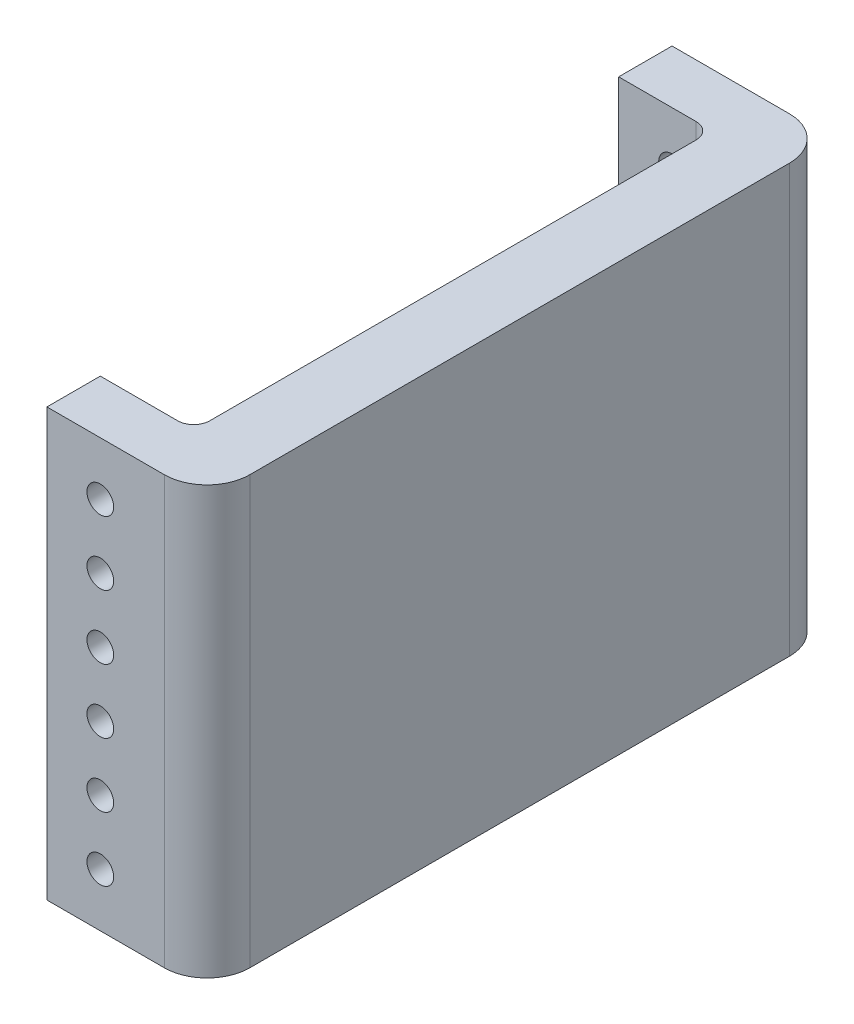
ISO-10303-21;
HEADER;
FILE_DESCRIPTION(('STEP AP214'),'2;1');
FILE_NAME('part.step','',(''),(''),'','','');
FILE_SCHEMA(('AUTOMOTIVE_DESIGN { 1 0 10303 214 1 1 1 1 }'));
ENDSEC;
DATA;
#1=APPLICATION_CONTEXT('core data for automotive mechanical design processes');
#2=APPLICATION_PROTOCOL_DEFINITION('international standard','automotive_design',2000,#1);
#3=PRODUCT_CONTEXT('',#1,'mechanical');
#4=PRODUCT('Part','Part','',(#3));
#5=PRODUCT_RELATED_PRODUCT_CATEGORY('part','',(#4));
#6=PRODUCT_DEFINITION_FORMATION('','',#4);
#7=PRODUCT_DEFINITION_CONTEXT('part definition',#1,'design');
#8=PRODUCT_DEFINITION('design','',#6,#7);
#9=PRODUCT_DEFINITION_SHAPE('','',#8);
#10=(LENGTH_UNIT() NAMED_UNIT(*) SI_UNIT(.MILLI.,.METRE.));
#11=(NAMED_UNIT(*) PLANE_ANGLE_UNIT() SI_UNIT($,.RADIAN.));
#12=(NAMED_UNIT(*) SI_UNIT($,.STERADIAN.) SOLID_ANGLE_UNIT());
#13=UNCERTAINTY_MEASURE_WITH_UNIT(LENGTH_MEASURE(1.E-05),#10,'distance_accuracy_value','');
#14=(GEOMETRIC_REPRESENTATION_CONTEXT(3) GLOBAL_UNCERTAINTY_ASSIGNED_CONTEXT((#13)) GLOBAL_UNIT_ASSIGNED_CONTEXT((#10,
#11,#12)) REPRESENTATION_CONTEXT('',''));
#15=CARTESIAN_POINT('',(0.,0.,0.));
#16=DIRECTION('',(0.,0.,1.));
#17=DIRECTION('',(1.,0.,0.));
#18=AXIS2_PLACEMENT_3D('',#15,#16,#17);
#19=CARTESIAN_POINT('',(0.,0.,0.));
#20=DIRECTION('',(1.,0.,0.));
#21=DIRECTION('',(0.,0.,-1.));
#22=AXIS2_PLACEMENT_3D('',#19,#20,#21);
#23=PLANE('',#22);
#24=DIRECTION('',(0.,0.,-1.));
#25=VECTOR('',#24,1.);
#26=CARTESIAN_POINT('',(0.,561.257561403509,837.51152631579));
#27=LINE('',#26,#25);
#28=CARTESIAN_POINT('',(0.,561.257561403509,565.47752631579));
#29=VERTEX_POINT('',#28);
#30=CARTESIAN_POINT('',(0.,561.257561403509,540.07752631579));
#31=VERTEX_POINT('',#30);
#32=EDGE_CURVE('E130',#29,#31,#27,.T.);
#33=ORIENTED_EDGE('',*,*,#32,.F.);
#34=DIRECTION('',(0.,1.,0.));
#35=VECTOR('',#34,1.);
#36=CARTESIAN_POINT('',(0.,561.257561403509,565.47752631579));
#37=LINE('',#36,#35);
#38=CARTESIAN_POINT('',(0.,764.457561403509,565.47752631579));
#39=VERTEX_POINT('',#38);
#40=EDGE_CURVE('E137',#29,#39,#37,.T.);
#41=ORIENTED_EDGE('',*,*,#40,.T.);
#42=DIRECTION('',(0.,0.,1.));
#43=VECTOR('',#42,1.);
#44=CARTESIAN_POINT('',(0.,764.457561403509,837.51152631579));
#45=LINE('',#44,#43);
#46=CARTESIAN_POINT('',(0.,764.457561403509,540.07752631579));
#47=VERTEX_POINT('',#46);
#48=EDGE_CURVE('E157',#47,#39,#45,.T.);
#49=ORIENTED_EDGE('',*,*,#48,.F.);
#50=DIRECTION('',(0.,1.,0.));
#51=VECTOR('',#50,1.);
#52=CARTESIAN_POINT('',(0.,764.457561403509,540.07752631579));
#53=LINE('',#52,#51);
#54=EDGE_CURVE('E147',#31,#47,#53,.T.);
#55=ORIENTED_EDGE('',*,*,#54,.F.);
#56=EDGE_LOOP('',(#33,#41,#49,#55));
#57=FACE_BOUND('',#56,.T.);
#58=ADVANCED_FACE('F39',(#57),#23,.F.);
#59=CARTESIAN_POINT('',(76.2,764.457561403509,837.51152631579));
#60=DIRECTION('',(0.,0.,-1.));
#61=DIRECTION('',(0.,1.,0.));
#62=AXIS2_PLACEMENT_3D('',#59,#60,#61);
#63=PLANE('',#62);
#64=CARTESIAN_POINT('',(25.4,739.057561403509,837.51152631579));
#65=DIRECTION('',(0.,0.,1.));
#66=DIRECTION('',(1.,0.,0.));
#67=AXIS2_PLACEMENT_3D('',#64,#65,#66);
#68=CIRCLE('',#67,6.35);
#69=CARTESIAN_POINT('',(31.75,739.057561403509,837.51152631579));
#70=VERTEX_POINT('',#69);
#71=EDGE_CURVE('E573',#70,#70,#68,.T.);
#72=ORIENTED_EDGE('',*,*,#71,.F.);
#73=EDGE_LOOP('',(#72));
#74=FACE_BOUND('',#73,.T.);
#75=CARTESIAN_POINT('',(25.4,708.577561403509,837.51152631579));
#76=DIRECTION('',(0.,0.,1.));
#77=DIRECTION('',(1.,0.,0.));
#78=AXIS2_PLACEMENT_3D('',#75,#76,#77);
#79=CIRCLE('',#78,6.35);
#80=CARTESIAN_POINT('',(31.75,708.577561403509,837.51152631579));
#81=VERTEX_POINT('',#80);
#82=EDGE_CURVE('E570',#81,#81,#79,.T.);
#83=ORIENTED_EDGE('',*,*,#82,.F.);
#84=EDGE_LOOP('',(#83));
#85=FACE_BOUND('',#84,.T.);
#86=CARTESIAN_POINT('',(25.4,678.097561403509,837.51152631579));
#87=DIRECTION('',(0.,0.,1.));
#88=DIRECTION('',(1.,0.,0.));
#89=AXIS2_PLACEMENT_3D('',#86,#87,#88);
#90=CIRCLE('',#89,6.35);
#91=CARTESIAN_POINT('',(31.75,678.097561403509,837.51152631579));
#92=VERTEX_POINT('',#91);
#93=EDGE_CURVE('E564',#92,#92,#90,.T.);
#94=ORIENTED_EDGE('',*,*,#93,.F.);
#95=EDGE_LOOP('',(#94));
#96=FACE_BOUND('',#95,.T.);
#97=CARTESIAN_POINT('',(25.4,647.617561403509,837.51152631579));
#98=DIRECTION('',(0.,0.,1.));
#99=DIRECTION('',(1.,0.,0.));
#100=AXIS2_PLACEMENT_3D('',#97,#98,#99);
#101=CIRCLE('',#100,6.35);
#102=CARTESIAN_POINT('',(31.75,647.617561403509,837.51152631579));
#103=VERTEX_POINT('',#102);
#104=EDGE_CURVE('E558',#103,#103,#101,.T.);
#105=ORIENTED_EDGE('',*,*,#104,.F.);
#106=EDGE_LOOP('',(#105));
#107=FACE_BOUND('',#106,.T.);
#108=CARTESIAN_POINT('',(25.4,617.137561403509,837.51152631579));
#109=DIRECTION('',(0.,0.,1.));
#110=DIRECTION('',(1.,0.,0.));
#111=AXIS2_PLACEMENT_3D('',#108,#109,#110);
#112=CIRCLE('',#111,6.35);
#113=CARTESIAN_POINT('',(31.75,617.137561403509,837.51152631579));
#114=VERTEX_POINT('',#113);
#115=EDGE_CURVE('E520',#114,#114,#112,.T.);
#116=ORIENTED_EDGE('',*,*,#115,.F.);
#117=EDGE_LOOP('',(#116));
#118=FACE_BOUND('',#117,.T.);
#119=CARTESIAN_POINT('',(25.4,586.657561403509,837.51152631579));
#120=DIRECTION('',(0.,0.,1.));
#121=DIRECTION('',(1.,0.,0.));
#122=AXIS2_PLACEMENT_3D('',#119,#120,#121);
#123=CIRCLE('',#122,6.35);
#124=CARTESIAN_POINT('',(31.75,586.657561403509,837.51152631579));
#125=VERTEX_POINT('',#124);
#126=EDGE_CURVE('E512',#125,#125,#123,.T.);
#127=ORIENTED_EDGE('',*,*,#126,.F.);
#128=EDGE_LOOP('',(#127));
#129=FACE_BOUND('',#128,.T.);
#130=DIRECTION('',(-1.,0.,0.));
#131=VECTOR('',#130,1.);
#132=CARTESIAN_POINT('',(76.2,561.257561403509,837.51152631579));
#133=LINE('',#132,#131);
#134=CARTESIAN_POINT('',(55.88,561.257561403509,837.51152631579));
#135=VERTEX_POINT('',#134);
#136=CARTESIAN_POINT('',(0.,561.257561403509,837.51152631579));
#137=VERTEX_POINT('',#136);
#138=EDGE_CURVE('E167',#135,#137,#133,.T.);
#139=ORIENTED_EDGE('',*,*,#138,.F.);
#140=DIRECTION('',(0.,-1.,0.));
#141=VECTOR('',#140,1.);
#142=CARTESIAN_POINT('',(55.88,764.457561403509,837.51152631579));
#143=LINE('',#142,#141);
#144=CARTESIAN_POINT('',(55.88,764.457561403509,837.51152631579));
#145=VERTEX_POINT('',#144);
#146=EDGE_CURVE('E210',#135,#145,#143,.F.);
#147=ORIENTED_EDGE('',*,*,#146,.T.);
#148=DIRECTION('',(-1.,0.,0.));
#149=VECTOR('',#148,1.);
#150=CARTESIAN_POINT('',(76.2,764.457561403509,837.51152631579));
#151=LINE('',#150,#149);
#152=CARTESIAN_POINT('',(0.,764.457561403509,837.51152631579));
#153=VERTEX_POINT('',#152);
#154=EDGE_CURVE('E160',#145,#153,#151,.T.);
#155=ORIENTED_EDGE('',*,*,#154,.T.);
#156=DIRECTION('',(0.,-1.,0.));
#157=VECTOR('',#156,1.);
#158=CARTESIAN_POINT('',(0.,764.457561403509,837.51152631579));
#159=LINE('',#158,#157);
#160=EDGE_CURVE('E144',#153,#137,#159,.T.);
#161=ORIENTED_EDGE('',*,*,#160,.T.);
#162=EDGE_LOOP('',(#139,#147,#155,#161));
#163=FACE_BOUND('',#162,.T.);
#164=ADVANCED_FACE('F244',(#74,#85,#96,#107,#118,#129,#163),#63,.F.);
#165=CARTESIAN_POINT('',(76.2,561.257561403509,837.51152631579));
#166=DIRECTION('',(0.,1.,0.));
#167=DIRECTION('',(0.,0.,1.));
#168=AXIS2_PLACEMENT_3D('',#165,#166,#167);
#169=PLANE('',#168);
#170=DIRECTION('',(-1.,0.,0.));
#171=VECTOR('',#170,1.);
#172=CARTESIAN_POINT('',(76.2,561.257561403509,540.07752631579));
#173=LINE('',#172,#171);
#174=CARTESIAN_POINT('',(55.88,561.257561403509,540.07752631579));
#175=VERTEX_POINT('',#174);
#176=EDGE_CURVE('E165',#175,#31,#173,.T.);
#177=ORIENTED_EDGE('',*,*,#176,.F.);
#178=CARTESIAN_POINT('',(55.88,561.257561403509,560.39752631579));
#179=DIRECTION('',(0.,1.,0.));
#180=DIRECTION('',(0.,0.,1.));
#181=AXIS2_PLACEMENT_3D('',#178,#179,#180);
#182=CIRCLE('',#181,20.32);
#183=CARTESIAN_POINT('',(76.2,561.257561403509,560.39752631579));
#184=VERTEX_POINT('',#183);
#185=EDGE_CURVE('E208',#175,#184,#182,.F.);
#186=ORIENTED_EDGE('',*,*,#185,.T.);
#187=DIRECTION('',(0.,0.,-1.));
#188=VECTOR('',#187,1.);
#189=CARTESIAN_POINT('',(76.2,561.257561403509,837.51152631579));
#190=LINE('',#189,#188);
#191=CARTESIAN_POINT('',(76.2,561.257561403509,817.19152631579));
#192=VERTEX_POINT('',#191);
#193=EDGE_CURVE('E159',#192,#184,#190,.T.);
#194=ORIENTED_EDGE('',*,*,#193,.F.);
#195=CARTESIAN_POINT('',(55.88,561.257561403509,817.19152631579));
#196=DIRECTION('',(0.,1.,0.));
#197=DIRECTION('',(0.,0.,1.));
#198=AXIS2_PLACEMENT_3D('',#195,#196,#197);
#199=CIRCLE('',#198,20.32);
#200=EDGE_CURVE('E206',#192,#135,#199,.F.);
#201=ORIENTED_EDGE('',*,*,#200,.T.);
#202=ORIENTED_EDGE('',*,*,#138,.T.);
#203=CARTESIAN_POINT('',(0.,561.257561403509,812.11152631579));
#204=VERTEX_POINT('',#203);
#205=EDGE_CURVE('E148',#137,#204,#27,.T.);
#206=ORIENTED_EDGE('',*,*,#205,.T.);
#207=DIRECTION('',(1.,0.,0.));
#208=VECTOR('',#207,1.);
#209=CARTESIAN_POINT('',(0.,561.257561403509,812.11152631579));
#210=LINE('',#209,#208);
#211=CARTESIAN_POINT('',(36.83,561.257561403509,812.11152631579));
#212=VERTEX_POINT('',#211);
#213=EDGE_CURVE('E281',#204,#212,#210,.T.);
#214=ORIENTED_EDGE('',*,*,#213,.T.);
#215=CARTESIAN_POINT('',(36.83,561.257561403509,804.49152631579));
#216=DIRECTION('',(0.,1.,0.));
#217=DIRECTION('',(0.,0.,1.));
#218=AXIS2_PLACEMENT_3D('',#215,#216,#217);
#219=CIRCLE('',#218,7.62);
#220=CARTESIAN_POINT('',(44.45,561.257561403509,804.49152631579));
#221=VERTEX_POINT('',#220);
#222=EDGE_CURVE('E223',#212,#221,#219,.T.);
#223=ORIENTED_EDGE('',*,*,#222,.T.);
#224=DIRECTION('',(0.,0.,-1.));
#225=VECTOR('',#224,1.);
#226=CARTESIAN_POINT('',(44.45,561.257561403509,565.47752631579));
#227=LINE('',#226,#225);
#228=CARTESIAN_POINT('',(44.45,561.257561403509,573.09752631579));
#229=VERTEX_POINT('',#228);
#230=EDGE_CURVE('E134',#221,#229,#227,.T.);
#231=ORIENTED_EDGE('',*,*,#230,.T.);
#232=CARTESIAN_POINT('',(36.83,561.257561403509,573.09752631579));
#233=DIRECTION('',(0.,1.,0.));
#234=DIRECTION('',(0.,0.,1.));
#235=AXIS2_PLACEMENT_3D('',#232,#233,#234);
#236=CIRCLE('',#235,7.62);
#237=CARTESIAN_POINT('',(36.83,561.257561403509,565.47752631579));
#238=VERTEX_POINT('',#237);
#239=EDGE_CURVE('E11',#229,#238,#236,.T.);
#240=ORIENTED_EDGE('',*,*,#239,.T.);
#241=DIRECTION('',(-1.,0.,0.));
#242=VECTOR('',#241,1.);
#243=CARTESIAN_POINT('',(0.,561.257561403509,565.47752631579));
#244=LINE('',#243,#242);
#245=EDGE_CURVE('E125',#238,#29,#244,.T.);
#246=ORIENTED_EDGE('',*,*,#245,.T.);
#247=ORIENTED_EDGE('',*,*,#32,.T.);
#248=EDGE_LOOP('',(#177,#186,#194,#201,#202,#206,#214,#223,#231,#240,#246,#247));
#249=FACE_BOUND('',#248,.T.);
#250=ADVANCED_FACE('F128',(#249),#169,.F.);
#251=CARTESIAN_POINT('',(76.2,764.457561403509,540.07752631579));
#252=DIRECTION('',(0.,0.,1.));
#253=DIRECTION('',(1.,0.,0.));
#254=AXIS2_PLACEMENT_3D('',#251,#252,#253);
#255=PLANE('',#254);
#256=CARTESIAN_POINT('',(25.4,739.057561403509,540.07752631579));
#257=DIRECTION('',(0.,0.,1.));
#258=DIRECTION('',(1.,0.,0.));
#259=AXIS2_PLACEMENT_3D('',#256,#257,#258);
#260=CIRCLE('',#259,6.35);
#261=CARTESIAN_POINT('',(31.75,739.057561403509,540.07752631579));
#262=VERTEX_POINT('',#261);
#263=EDGE_CURVE('E174',#262,#262,#260,.T.);
#264=ORIENTED_EDGE('',*,*,#263,.T.);
#265=EDGE_LOOP('',(#264));
#266=FACE_BOUND('',#265,.T.);
#267=CARTESIAN_POINT('',(25.4,708.577561403509,540.07752631579));
#268=DIRECTION('',(0.,0.,1.));
#269=DIRECTION('',(1.,0.,0.));
#270=AXIS2_PLACEMENT_3D('',#267,#268,#269);
#271=CIRCLE('',#270,6.35);
#272=CARTESIAN_POINT('',(31.75,708.577561403509,540.07752631579));
#273=VERTEX_POINT('',#272);
#274=EDGE_CURVE('E567',#273,#273,#271,.T.);
#275=ORIENTED_EDGE('',*,*,#274,.T.);
#276=EDGE_LOOP('',(#275));
#277=FACE_BOUND('',#276,.T.);
#278=CARTESIAN_POINT('',(25.4,678.097561403509,540.07752631579));
#279=DIRECTION('',(0.,0.,1.));
#280=DIRECTION('',(1.,0.,0.));
#281=AXIS2_PLACEMENT_3D('',#278,#279,#280);
#282=CIRCLE('',#281,6.35);
#283=CARTESIAN_POINT('',(31.75,678.097561403509,540.07752631579));
#284=VERTEX_POINT('',#283);
#285=EDGE_CURVE('E561',#284,#284,#282,.T.);
#286=ORIENTED_EDGE('',*,*,#285,.T.);
#287=EDGE_LOOP('',(#286));
#288=FACE_BOUND('',#287,.T.);
#289=CARTESIAN_POINT('',(25.4,647.617561403509,540.07752631579));
#290=DIRECTION('',(0.,0.,1.));
#291=DIRECTION('',(1.,0.,0.));
#292=AXIS2_PLACEMENT_3D('',#289,#290,#291);
#293=CIRCLE('',#292,6.35);
#294=CARTESIAN_POINT('',(31.75,647.617561403509,540.07752631579));
#295=VERTEX_POINT('',#294);
#296=EDGE_CURVE('E555',#295,#295,#293,.T.);
#297=ORIENTED_EDGE('',*,*,#296,.T.);
#298=EDGE_LOOP('',(#297));
#299=FACE_BOUND('',#298,.T.);
#300=CARTESIAN_POINT('',(25.4,617.137561403509,540.07752631579));
#301=DIRECTION('',(0.,0.,1.));
#302=DIRECTION('',(1.,0.,0.));
#303=AXIS2_PLACEMENT_3D('',#300,#301,#302);
#304=CIRCLE('',#303,6.35);
#305=CARTESIAN_POINT('',(31.75,617.137561403509,540.07752631579));
#306=VERTEX_POINT('',#305);
#307=EDGE_CURVE('E516',#306,#306,#304,.T.);
#308=ORIENTED_EDGE('',*,*,#307,.T.);
#309=EDGE_LOOP('',(#308));
#310=FACE_BOUND('',#309,.T.);
#311=CARTESIAN_POINT('',(25.4,586.657561403509,540.07752631579));
#312=DIRECTION('',(0.,0.,1.));
#313=DIRECTION('',(1.,0.,0.));
#314=AXIS2_PLACEMENT_3D('',#311,#312,#313);
#315=CIRCLE('',#314,6.35);
#316=CARTESIAN_POINT('',(31.75,586.657561403509,540.07752631579));
#317=VERTEX_POINT('',#316);
#318=EDGE_CURVE('E517',#317,#317,#315,.T.);
#319=ORIENTED_EDGE('',*,*,#318,.T.);
#320=EDGE_LOOP('',(#319));
#321=FACE_BOUND('',#320,.T.);
#322=DIRECTION('',(-1.,0.,0.));
#323=VECTOR('',#322,1.);
#324=CARTESIAN_POINT('',(76.2,764.457561403509,540.07752631579));
#325=LINE('',#324,#323);
#326=CARTESIAN_POINT('',(55.88,764.457561403509,540.07752631579));
#327=VERTEX_POINT('',#326);
#328=EDGE_CURVE('E162',#327,#47,#325,.T.);
#329=ORIENTED_EDGE('',*,*,#328,.F.);
#330=DIRECTION('',(0.,1.,0.));
#331=VECTOR('',#330,1.);
#332=CARTESIAN_POINT('',(55.88,561.257561403509,540.07752631579));
#333=LINE('',#332,#331);
#334=EDGE_CURVE('E204',#327,#175,#333,.F.);
#335=ORIENTED_EDGE('',*,*,#334,.T.);
#336=ORIENTED_EDGE('',*,*,#176,.T.);
#337=ORIENTED_EDGE('',*,*,#54,.T.);
#338=EDGE_LOOP('',(#329,#335,#336,#337));
#339=FACE_BOUND('',#338,.T.);
#340=ADVANCED_FACE('F299',(#266,#277,#288,#299,#310,#321,#339),#255,.F.);
#341=CARTESIAN_POINT('',(76.2,764.457561403509,837.51152631579));
#342=DIRECTION('',(0.,-1.,0.));
#343=DIRECTION('',(0.,0.,-1.));
#344=AXIS2_PLACEMENT_3D('',#341,#342,#343);
#345=PLANE('',#344);
#346=DIRECTION('',(0.,0.,1.));
#347=VECTOR('',#346,1.);
#348=CARTESIAN_POINT('',(76.2,764.457561403509,837.51152631579));
#349=LINE('',#348,#347);
#350=CARTESIAN_POINT('',(76.2,764.457561403509,560.39752631579));
#351=VERTEX_POINT('',#350);
#352=CARTESIAN_POINT('',(76.2,764.457561403509,817.19152631579));
#353=VERTEX_POINT('',#352);
#354=EDGE_CURVE('E163',#351,#353,#349,.T.);
#355=ORIENTED_EDGE('',*,*,#354,.F.);
#356=CARTESIAN_POINT('',(55.88,764.457561403509,560.39752631579));
#357=DIRECTION('',(0.,-1.,0.));
#358=DIRECTION('',(0.,0.,-1.));
#359=AXIS2_PLACEMENT_3D('',#356,#357,#358);
#360=CIRCLE('',#359,20.32);
#361=EDGE_CURVE('E202',#351,#327,#360,.F.);
#362=ORIENTED_EDGE('',*,*,#361,.T.);
#363=ORIENTED_EDGE('',*,*,#328,.T.);
#364=ORIENTED_EDGE('',*,*,#48,.T.);
#365=DIRECTION('',(-1.,0.,0.));
#366=VECTOR('',#365,1.);
#367=CARTESIAN_POINT('',(0.,764.457561403509,565.47752631579));
#368=LINE('',#367,#366);
#369=CARTESIAN_POINT('',(36.83,764.457561403509,565.47752631579));
#370=VERTEX_POINT('',#369);
#371=EDGE_CURVE('E140',#370,#39,#368,.T.);
#372=ORIENTED_EDGE('',*,*,#371,.F.);
#373=CARTESIAN_POINT('',(36.83,764.457561403509,573.09752631579));
#374=DIRECTION('',(0.,-1.,0.));
#375=DIRECTION('',(0.,0.,-1.));
#376=AXIS2_PLACEMENT_3D('',#373,#374,#375);
#377=CIRCLE('',#376,7.62);
#378=CARTESIAN_POINT('',(44.45,764.457561403509,573.09752631579));
#379=VERTEX_POINT('',#378);
#380=EDGE_CURVE('E47',#370,#379,#377,.T.);
#381=ORIENTED_EDGE('',*,*,#380,.T.);
#382=DIRECTION('',(0.,0.,-1.));
#383=VECTOR('',#382,1.);
#384=CARTESIAN_POINT('',(44.45,764.457561403509,565.47752631579));
#385=LINE('',#384,#383);
#386=CARTESIAN_POINT('',(44.45,764.457561403509,804.49152631579));
#387=VERTEX_POINT('',#386);
#388=EDGE_CURVE('E229',#387,#379,#385,.T.);
#389=ORIENTED_EDGE('',*,*,#388,.F.);
#390=CARTESIAN_POINT('',(36.83,764.457561403509,804.49152631579));
#391=DIRECTION('',(0.,-1.,0.));
#392=DIRECTION('',(0.,0.,-1.));
#393=AXIS2_PLACEMENT_3D('',#390,#391,#392);
#394=CIRCLE('',#393,7.62);
#395=CARTESIAN_POINT('',(36.83,764.457561403509,812.11152631579));
#396=VERTEX_POINT('',#395);
#397=EDGE_CURVE('E221',#387,#396,#394,.T.);
#398=ORIENTED_EDGE('',*,*,#397,.T.);
#399=DIRECTION('',(1.,0.,0.));
#400=VECTOR('',#399,1.);
#401=CARTESIAN_POINT('',(0.,764.457561403509,812.11152631579));
#402=LINE('',#401,#400);
#403=CARTESIAN_POINT('',(0.,764.457561403509,812.11152631579));
#404=VERTEX_POINT('',#403);
#405=EDGE_CURVE('E234',#404,#396,#402,.T.);
#406=ORIENTED_EDGE('',*,*,#405,.F.);
#407=EDGE_CURVE('E156',#404,#153,#45,.T.);
#408=ORIENTED_EDGE('',*,*,#407,.T.);
#409=ORIENTED_EDGE('',*,*,#154,.F.);
#410=CARTESIAN_POINT('',(55.88,764.457561403509,817.19152631579));
#411=DIRECTION('',(0.,-1.,0.));
#412=DIRECTION('',(0.,0.,-1.));
#413=AXIS2_PLACEMENT_3D('',#410,#411,#412);
#414=CIRCLE('',#413,20.32);
#415=EDGE_CURVE('E200',#145,#353,#414,.F.);
#416=ORIENTED_EDGE('',*,*,#415,.T.);
#417=EDGE_LOOP('',(#355,#362,#363,#364,#372,#381,#389,#398,#406,#408,#409,#416));
#418=FACE_BOUND('',#417,.T.);
#419=ADVANCED_FACE('F228',(#418),#345,.F.);
#420=CARTESIAN_POINT('',(76.2,0.,0.));
#421=DIRECTION('',(1.,0.,0.));
#422=DIRECTION('',(0.,0.,-1.));
#423=AXIS2_PLACEMENT_3D('',#420,#421,#422);
#424=PLANE('',#423);
#425=ORIENTED_EDGE('',*,*,#193,.T.);
#426=DIRECTION('',(0.,1.,0.));
#427=VECTOR('',#426,1.);
#428=CARTESIAN_POINT('',(76.2,764.457561403509,560.39752631579));
#429=LINE('',#428,#427);
#430=EDGE_CURVE('E197',#184,#351,#429,.T.);
#431=ORIENTED_EDGE('',*,*,#430,.T.);
#432=ORIENTED_EDGE('',*,*,#354,.T.);
#433=DIRECTION('',(0.,-1.,0.));
#434=VECTOR('',#433,1.);
#435=CARTESIAN_POINT('',(76.2,561.257561403509,817.19152631579));
#436=LINE('',#435,#434);
#437=EDGE_CURVE('E169',#353,#192,#436,.T.);
#438=ORIENTED_EDGE('',*,*,#437,.T.);
#439=EDGE_LOOP('',(#425,#431,#432,#438));
#440=FACE_BOUND('',#439,.T.);
#441=ADVANCED_FACE('F255',(#440),#424,.T.);
#442=ORIENTED_EDGE('',*,*,#407,.F.);
#443=DIRECTION('',(0.,1.,0.));
#444=VECTOR('',#443,1.);
#445=CARTESIAN_POINT('',(0.,561.257561403509,812.11152631579));
#446=LINE('',#445,#444);
#447=EDGE_CURVE('E133',#204,#404,#446,.T.);
#448=ORIENTED_EDGE('',*,*,#447,.F.);
#449=ORIENTED_EDGE('',*,*,#205,.F.);
#450=ORIENTED_EDGE('',*,*,#160,.F.);
#451=EDGE_LOOP('',(#442,#448,#449,#450));
#452=FACE_BOUND('',#451,.T.);
#453=ADVANCED_FACE('F246',(#452),#23,.F.);
#454=CARTESIAN_POINT('',(0.,561.257561403509,565.47752631579));
#455=DIRECTION('',(0.,0.,-1.));
#456=DIRECTION('',(-1.,0.,0.));
#457=AXIS2_PLACEMENT_3D('',#454,#455,#456);
#458=PLANE('',#457);
#459=CARTESIAN_POINT('',(25.4,739.057561403509,565.47752631579));
#460=DIRECTION('',(0.,0.,-1.));
#461=DIRECTION('',(-1.,0.,0.));
#462=AXIS2_PLACEMENT_3D('',#459,#460,#461);
#463=CIRCLE('',#462,6.35);
#464=CARTESIAN_POINT('',(19.05,739.057561403509,565.47752631579));
#465=VERTEX_POINT('',#464);
#466=EDGE_CURVE('E194',#465,#465,#463,.T.);
#467=ORIENTED_EDGE('',*,*,#466,.T.);
#468=EDGE_LOOP('',(#467));
#469=FACE_BOUND('',#468,.T.);
#470=CARTESIAN_POINT('',(25.4,708.577561403509,565.47752631579));
#471=DIRECTION('',(0.,0.,-1.));
#472=DIRECTION('',(-1.,0.,0.));
#473=AXIS2_PLACEMENT_3D('',#470,#471,#472);
#474=CIRCLE('',#473,6.35);
#475=CARTESIAN_POINT('',(19.05,708.577561403509,565.47752631579));
#476=VERTEX_POINT('',#475);
#477=EDGE_CURVE('E190',#476,#476,#474,.T.);
#478=ORIENTED_EDGE('',*,*,#477,.T.);
#479=EDGE_LOOP('',(#478));
#480=FACE_BOUND('',#479,.T.);
#481=CARTESIAN_POINT('',(25.4,678.097561403509,565.47752631579));
#482=DIRECTION('',(0.,0.,-1.));
#483=DIRECTION('',(-1.,0.,0.));
#484=AXIS2_PLACEMENT_3D('',#481,#482,#483);
#485=CIRCLE('',#484,6.35);
#486=CARTESIAN_POINT('',(19.05,678.097561403509,565.47752631579));
#487=VERTEX_POINT('',#486);
#488=EDGE_CURVE('E186',#487,#487,#485,.T.);
#489=ORIENTED_EDGE('',*,*,#488,.T.);
#490=EDGE_LOOP('',(#489));
#491=FACE_BOUND('',#490,.T.);
#492=CARTESIAN_POINT('',(25.4,647.617561403509,565.47752631579));
#493=DIRECTION('',(0.,0.,-1.));
#494=DIRECTION('',(-1.,0.,0.));
#495=AXIS2_PLACEMENT_3D('',#492,#493,#494);
#496=CIRCLE('',#495,6.35);
#497=CARTESIAN_POINT('',(19.05,647.617561403509,565.47752631579));
#498=VERTEX_POINT('',#497);
#499=EDGE_CURVE('E182',#498,#498,#496,.T.);
#500=ORIENTED_EDGE('',*,*,#499,.T.);
#501=EDGE_LOOP('',(#500));
#502=FACE_BOUND('',#501,.T.);
#503=CARTESIAN_POINT('',(25.4,617.137561403509,565.47752631579));
#504=DIRECTION('',(0.,0.,-1.));
#505=DIRECTION('',(-1.,0.,0.));
#506=AXIS2_PLACEMENT_3D('',#503,#504,#505);
#507=CIRCLE('',#506,6.35);
#508=CARTESIAN_POINT('',(19.05,617.137561403509,565.47752631579));
#509=VERTEX_POINT('',#508);
#510=EDGE_CURVE('E178',#509,#509,#507,.T.);
#511=ORIENTED_EDGE('',*,*,#510,.T.);
#512=EDGE_LOOP('',(#511));
#513=FACE_BOUND('',#512,.T.);
#514=CARTESIAN_POINT('',(25.4,586.657561403509,565.47752631579));
#515=DIRECTION('',(0.,0.,-1.));
#516=DIRECTION('',(-1.,0.,0.));
#517=AXIS2_PLACEMENT_3D('',#514,#515,#516);
#518=CIRCLE('',#517,6.35);
#519=CARTESIAN_POINT('',(19.05,586.657561403509,565.47752631579));
#520=VERTEX_POINT('',#519);
#521=EDGE_CURVE('E173',#520,#520,#518,.T.);
#522=ORIENTED_EDGE('',*,*,#521,.T.);
#523=EDGE_LOOP('',(#522));
#524=FACE_BOUND('',#523,.T.);
#525=ORIENTED_EDGE('',*,*,#245,.F.);
#526=DIRECTION('',(0.,1.,0.));
#527=VECTOR('',#526,1.);
#528=CARTESIAN_POINT('',(36.83,764.457561403509,565.47752631579));
#529=LINE('',#528,#527);
#530=EDGE_CURVE('E219',#238,#370,#529,.T.);
#531=ORIENTED_EDGE('',*,*,#530,.T.);
#532=ORIENTED_EDGE('',*,*,#371,.T.);
#533=ORIENTED_EDGE('',*,*,#40,.F.);
#534=EDGE_LOOP('',(#525,#531,#532,#533));
#535=FACE_BOUND('',#534,.T.);
#536=ADVANCED_FACE('F138',(#469,#480,#491,#502,#513,#524,#535),#458,.F.);
#537=CARTESIAN_POINT('',(44.45,561.257561403509,565.47752631579));
#538=DIRECTION('',(1.,0.,0.));
#539=DIRECTION('',(0.,0.,-1.));
#540=AXIS2_PLACEMENT_3D('',#537,#538,#539);
#541=PLANE('',#540);
#542=ORIENTED_EDGE('',*,*,#230,.F.);
#543=DIRECTION('',(0.,1.,0.));
#544=VECTOR('',#543,1.);
#545=CARTESIAN_POINT('',(44.45,764.457561403509,804.49152631579));
#546=LINE('',#545,#544);
#547=EDGE_CURVE('E214',#221,#387,#546,.T.);
#548=ORIENTED_EDGE('',*,*,#547,.T.);
#549=ORIENTED_EDGE('',*,*,#388,.T.);
#550=DIRECTION('',(0.,1.,0.));
#551=VECTOR('',#550,1.);
#552=CARTESIAN_POINT('',(44.45,561.257561403509,573.09752631579));
#553=LINE('',#552,#551);
#554=EDGE_CURVE('E212',#379,#229,#553,.F.);
#555=ORIENTED_EDGE('',*,*,#554,.T.);
#556=EDGE_LOOP('',(#542,#548,#549,#555));
#557=FACE_BOUND('',#556,.T.);
#558=ADVANCED_FACE('F232',(#557),#541,.F.);
#559=CARTESIAN_POINT('',(0.,561.257561403509,812.11152631579));
#560=DIRECTION('',(0.,0.,1.));
#561=DIRECTION('',(1.,0.,0.));
#562=AXIS2_PLACEMENT_3D('',#559,#560,#561);
#563=PLANE('',#562);
#564=CARTESIAN_POINT('',(25.4,739.057561403509,812.11152631579));
#565=DIRECTION('',(0.,0.,1.));
#566=DIRECTION('',(1.,0.,0.));
#567=AXIS2_PLACEMENT_3D('',#564,#565,#566);
#568=CIRCLE('',#567,6.35);
#569=CARTESIAN_POINT('',(31.75,739.057561403509,812.11152631579));
#570=VERTEX_POINT('',#569);
#571=EDGE_CURVE('E191',#570,#570,#568,.T.);
#572=ORIENTED_EDGE('',*,*,#571,.T.);
#573=EDGE_LOOP('',(#572));
#574=FACE_BOUND('',#573,.T.);
#575=CARTESIAN_POINT('',(25.4,708.577561403509,812.11152631579));
#576=DIRECTION('',(0.,0.,1.));
#577=DIRECTION('',(1.,0.,0.));
#578=AXIS2_PLACEMENT_3D('',#575,#576,#577);
#579=CIRCLE('',#578,6.35);
#580=CARTESIAN_POINT('',(31.75,708.577561403509,812.11152631579));
#581=VERTEX_POINT('',#580);
#582=EDGE_CURVE('E187',#581,#581,#579,.T.);
#583=ORIENTED_EDGE('',*,*,#582,.T.);
#584=EDGE_LOOP('',(#583));
#585=FACE_BOUND('',#584,.T.);
#586=CARTESIAN_POINT('',(25.4,678.097561403509,812.11152631579));
#587=DIRECTION('',(0.,0.,1.));
#588=DIRECTION('',(1.,0.,0.));
#589=AXIS2_PLACEMENT_3D('',#586,#587,#588);
#590=CIRCLE('',#589,6.35);
#591=CARTESIAN_POINT('',(31.75,678.097561403509,812.11152631579));
#592=VERTEX_POINT('',#591);
#593=EDGE_CURVE('E183',#592,#592,#590,.T.);
#594=ORIENTED_EDGE('',*,*,#593,.T.);
#595=EDGE_LOOP('',(#594));
#596=FACE_BOUND('',#595,.T.);
#597=CARTESIAN_POINT('',(25.4,647.617561403509,812.11152631579));
#598=DIRECTION('',(0.,0.,1.));
#599=DIRECTION('',(1.,0.,0.));
#600=AXIS2_PLACEMENT_3D('',#597,#598,#599);
#601=CIRCLE('',#600,6.35);
#602=CARTESIAN_POINT('',(31.75,647.617561403509,812.11152631579));
#603=VERTEX_POINT('',#602);
#604=EDGE_CURVE('E179',#603,#603,#601,.T.);
#605=ORIENTED_EDGE('',*,*,#604,.T.);
#606=EDGE_LOOP('',(#605));
#607=FACE_BOUND('',#606,.T.);
#608=CARTESIAN_POINT('',(25.4,617.137561403509,812.11152631579));
#609=DIRECTION('',(0.,0.,1.));
#610=DIRECTION('',(1.,0.,0.));
#611=AXIS2_PLACEMENT_3D('',#608,#609,#610);
#612=CIRCLE('',#611,6.35);
#613=CARTESIAN_POINT('',(31.75,617.137561403509,812.11152631579));
#614=VERTEX_POINT('',#613);
#615=EDGE_CURVE('E175',#614,#614,#612,.T.);
#616=ORIENTED_EDGE('',*,*,#615,.T.);
#617=EDGE_LOOP('',(#616));
#618=FACE_BOUND('',#617,.T.);
#619=CARTESIAN_POINT('',(25.4,586.657561403509,812.11152631579));
#620=DIRECTION('',(0.,0.,1.));
#621=DIRECTION('',(1.,0.,0.));
#622=AXIS2_PLACEMENT_3D('',#619,#620,#621);
#623=CIRCLE('',#622,6.35);
#624=CARTESIAN_POINT('',(31.75,586.657561403509,812.11152631579));
#625=VERTEX_POINT('',#624);
#626=EDGE_CURVE('E170',#625,#625,#623,.T.);
#627=ORIENTED_EDGE('',*,*,#626,.T.);
#628=EDGE_LOOP('',(#627));
#629=FACE_BOUND('',#628,.T.);
#630=ORIENTED_EDGE('',*,*,#405,.T.);
#631=DIRECTION('',(0.,1.,0.));
#632=VECTOR('',#631,1.);
#633=CARTESIAN_POINT('',(36.83,561.257561403509,812.11152631579));
#634=LINE('',#633,#632);
#635=EDGE_CURVE('E217',#396,#212,#634,.F.);
#636=ORIENTED_EDGE('',*,*,#635,.T.);
#637=ORIENTED_EDGE('',*,*,#213,.F.);
#638=ORIENTED_EDGE('',*,*,#447,.T.);
#639=EDGE_LOOP('',(#630,#636,#637,#638));
#640=FACE_BOUND('',#639,.T.);
#641=ADVANCED_FACE('F345',(#574,#585,#596,#607,#618,#629,#640),#563,.F.);
#642=CARTESIAN_POINT('',(25.4,586.657561403509,540.07752631579));
#643=DIRECTION('',(0.,0.,1.));
#644=DIRECTION('',(1.,0.,0.));
#645=AXIS2_PLACEMENT_3D('',#642,#643,#644);
#646=CYLINDRICAL_SURFACE('',#645,6.35);
#647=ORIENTED_EDGE('',*,*,#126,.T.);
#648=EDGE_LOOP('',(#647));
#649=FACE_BOUND('',#648,.T.);
#650=ORIENTED_EDGE('',*,*,#626,.F.);
#651=EDGE_LOOP('',(#650));
#652=FACE_BOUND('',#651,.T.);
#653=ADVANCED_FACE('F352',(#649,#652),#646,.F.);
#654=CARTESIAN_POINT('',(25.4,617.137561403509,540.07752631579));
#655=DIRECTION('',(0.,0.,1.));
#656=DIRECTION('',(1.,0.,0.));
#657=AXIS2_PLACEMENT_3D('',#654,#655,#656);
#658=CYLINDRICAL_SURFACE('',#657,6.35);
#659=ORIENTED_EDGE('',*,*,#115,.T.);
#660=EDGE_LOOP('',(#659));
#661=FACE_BOUND('',#660,.T.);
#662=ORIENTED_EDGE('',*,*,#615,.F.);
#663=EDGE_LOOP('',(#662));
#664=FACE_BOUND('',#663,.T.);
#665=ADVANCED_FACE('F421',(#661,#664),#658,.F.);
#666=CARTESIAN_POINT('',(25.4,647.617561403509,540.07752631579));
#667=DIRECTION('',(0.,0.,1.));
#668=DIRECTION('',(1.,0.,0.));
#669=AXIS2_PLACEMENT_3D('',#666,#667,#668);
#670=CYLINDRICAL_SURFACE('',#669,6.35);
#671=ORIENTED_EDGE('',*,*,#104,.T.);
#672=EDGE_LOOP('',(#671));
#673=FACE_BOUND('',#672,.T.);
#674=ORIENTED_EDGE('',*,*,#604,.F.);
#675=EDGE_LOOP('',(#674));
#676=FACE_BOUND('',#675,.T.);
#677=ADVANCED_FACE('F411',(#673,#676),#670,.F.);
#678=CARTESIAN_POINT('',(25.4,678.097561403509,540.07752631579));
#679=DIRECTION('',(0.,0.,1.));
#680=DIRECTION('',(1.,0.,0.));
#681=AXIS2_PLACEMENT_3D('',#678,#679,#680);
#682=CYLINDRICAL_SURFACE('',#681,6.35);
#683=ORIENTED_EDGE('',*,*,#93,.T.);
#684=EDGE_LOOP('',(#683));
#685=FACE_BOUND('',#684,.T.);
#686=ORIENTED_EDGE('',*,*,#593,.F.);
#687=EDGE_LOOP('',(#686));
#688=FACE_BOUND('',#687,.T.);
#689=ADVANCED_FACE('F401',(#685,#688),#682,.F.);
#690=CARTESIAN_POINT('',(25.4,708.577561403509,540.07752631579));
#691=DIRECTION('',(0.,0.,1.));
#692=DIRECTION('',(1.,0.,0.));
#693=AXIS2_PLACEMENT_3D('',#690,#691,#692);
#694=CYLINDRICAL_SURFACE('',#693,6.35);
#695=ORIENTED_EDGE('',*,*,#82,.T.);
#696=EDGE_LOOP('',(#695));
#697=FACE_BOUND('',#696,.T.);
#698=ORIENTED_EDGE('',*,*,#582,.F.);
#699=EDGE_LOOP('',(#698));
#700=FACE_BOUND('',#699,.T.);
#701=ADVANCED_FACE('F391',(#697,#700),#694,.F.);
#702=CARTESIAN_POINT('',(25.4,739.057561403509,540.07752631579));
#703=DIRECTION('',(0.,0.,1.));
#704=DIRECTION('',(1.,0.,0.));
#705=AXIS2_PLACEMENT_3D('',#702,#703,#704);
#706=CYLINDRICAL_SURFACE('',#705,6.35);
#707=ORIENTED_EDGE('',*,*,#71,.T.);
#708=EDGE_LOOP('',(#707));
#709=FACE_BOUND('',#708,.T.);
#710=ORIENTED_EDGE('',*,*,#571,.F.);
#711=EDGE_LOOP('',(#710));
#712=FACE_BOUND('',#711,.T.);
#713=ADVANCED_FACE('F381',(#709,#712),#706,.F.);
#714=ORIENTED_EDGE('',*,*,#318,.F.);
#715=EDGE_LOOP('',(#714));
#716=FACE_BOUND('',#715,.T.);
#717=ORIENTED_EDGE('',*,*,#521,.F.);
#718=EDGE_LOOP('',(#717));
#719=FACE_BOUND('',#718,.T.);
#720=ADVANCED_FACE('F418',(#716,#719),#646,.F.);
#721=ORIENTED_EDGE('',*,*,#307,.F.);
#722=EDGE_LOOP('',(#721));
#723=FACE_BOUND('',#722,.T.);
#724=ORIENTED_EDGE('',*,*,#510,.F.);
#725=EDGE_LOOP('',(#724));
#726=FACE_BOUND('',#725,.T.);
#727=ADVANCED_FACE('F408',(#723,#726),#658,.F.);
#728=ORIENTED_EDGE('',*,*,#296,.F.);
#729=EDGE_LOOP('',(#728));
#730=FACE_BOUND('',#729,.T.);
#731=ORIENTED_EDGE('',*,*,#499,.F.);
#732=EDGE_LOOP('',(#731));
#733=FACE_BOUND('',#732,.T.);
#734=ADVANCED_FACE('F398',(#730,#733),#670,.F.);
#735=ORIENTED_EDGE('',*,*,#285,.F.);
#736=EDGE_LOOP('',(#735));
#737=FACE_BOUND('',#736,.T.);
#738=ORIENTED_EDGE('',*,*,#488,.F.);
#739=EDGE_LOOP('',(#738));
#740=FACE_BOUND('',#739,.T.);
#741=ADVANCED_FACE('F388',(#737,#740),#682,.F.);
#742=ORIENTED_EDGE('',*,*,#274,.F.);
#743=EDGE_LOOP('',(#742));
#744=FACE_BOUND('',#743,.T.);
#745=ORIENTED_EDGE('',*,*,#477,.F.);
#746=EDGE_LOOP('',(#745));
#747=FACE_BOUND('',#746,.T.);
#748=ADVANCED_FACE('F378',(#744,#747),#694,.F.);
#749=ORIENTED_EDGE('',*,*,#263,.F.);
#750=EDGE_LOOP('',(#749));
#751=FACE_BOUND('',#750,.T.);
#752=ORIENTED_EDGE('',*,*,#466,.F.);
#753=EDGE_LOOP('',(#752));
#754=FACE_BOUND('',#753,.T.);
#755=ADVANCED_FACE('F313',(#751,#754),#706,.F.);
#756=CARTESIAN_POINT('',(55.88,0.,560.39752631579));
#757=DIRECTION('',(0.,-1.,0.));
#758=DIRECTION('',(0.,0.,-1.));
#759=AXIS2_PLACEMENT_3D('',#756,#757,#758);
#760=CYLINDRICAL_SURFACE('',#759,20.32);
#761=ORIENTED_EDGE('',*,*,#185,.F.);
#762=ORIENTED_EDGE('',*,*,#334,.F.);
#763=ORIENTED_EDGE('',*,*,#361,.F.);
#764=ORIENTED_EDGE('',*,*,#430,.F.);
#765=EDGE_LOOP('',(#761,#762,#763,#764));
#766=FACE_BOUND('',#765,.T.);
#767=ADVANCED_FACE('F295',(#766),#760,.T.);
#768=CARTESIAN_POINT('',(55.88,-4.46488606321045E-13,817.19152631579));
#769=DIRECTION('',(0.,1.,0.));
#770=DIRECTION('',(0.,0.,1.));
#771=AXIS2_PLACEMENT_3D('',#768,#769,#770);
#772=CYLINDRICAL_SURFACE('',#771,20.32);
#773=ORIENTED_EDGE('',*,*,#415,.F.);
#774=ORIENTED_EDGE('',*,*,#146,.F.);
#775=ORIENTED_EDGE('',*,*,#200,.F.);
#776=ORIENTED_EDGE('',*,*,#437,.F.);
#777=EDGE_LOOP('',(#773,#774,#775,#776));
#778=FACE_BOUND('',#777,.T.);
#779=ADVANCED_FACE('F241',(#778),#772,.T.);
#780=CARTESIAN_POINT('',(36.83,561.257561403509,804.49152631579));
#781=DIRECTION('',(0.,-1.,0.));
#782=DIRECTION('',(0.,0.,-1.));
#783=AXIS2_PLACEMENT_3D('',#780,#781,#782);
#784=CYLINDRICAL_SURFACE('',#783,7.62);
#785=ORIENTED_EDGE('',*,*,#222,.F.);
#786=ORIENTED_EDGE('',*,*,#635,.F.);
#787=ORIENTED_EDGE('',*,*,#397,.F.);
#788=ORIENTED_EDGE('',*,*,#547,.F.);
#789=EDGE_LOOP('',(#785,#786,#787,#788));
#790=FACE_BOUND('',#789,.T.);
#791=ADVANCED_FACE('F237',(#790),#784,.F.);
#792=CARTESIAN_POINT('',(36.83,561.257561403509,573.09752631579));
#793=DIRECTION('',(0.,-1.,0.));
#794=DIRECTION('',(0.,0.,-1.));
#795=AXIS2_PLACEMENT_3D('',#792,#793,#794);
#796=CYLINDRICAL_SURFACE('',#795,7.62);
#797=ORIENTED_EDGE('',*,*,#239,.F.);
#798=ORIENTED_EDGE('',*,*,#554,.F.);
#799=ORIENTED_EDGE('',*,*,#380,.F.);
#800=ORIENTED_EDGE('',*,*,#530,.F.);
#801=EDGE_LOOP('',(#797,#798,#799,#800));
#802=FACE_BOUND('',#801,.T.);
#803=ADVANCED_FACE('F41',(#802),#796,.F.);
#804=CLOSED_SHELL('',(#58,#164,#250,#340,#419,#441,#453,#536,#558,#641,#653,#665,#677,#689,#701,
#713,#720,#727,#734,#741,#748,#755,#767,#779,#791,#803));
#805=MANIFOLD_SOLID_BREP('B2',#804);
#806=ADVANCED_BREP_SHAPE_REPRESENTATION('',(#18,#805),#14);
#807=SHAPE_DEFINITION_REPRESENTATION(#9,#806);
ENDSEC;
END-ISO-10303-21;
